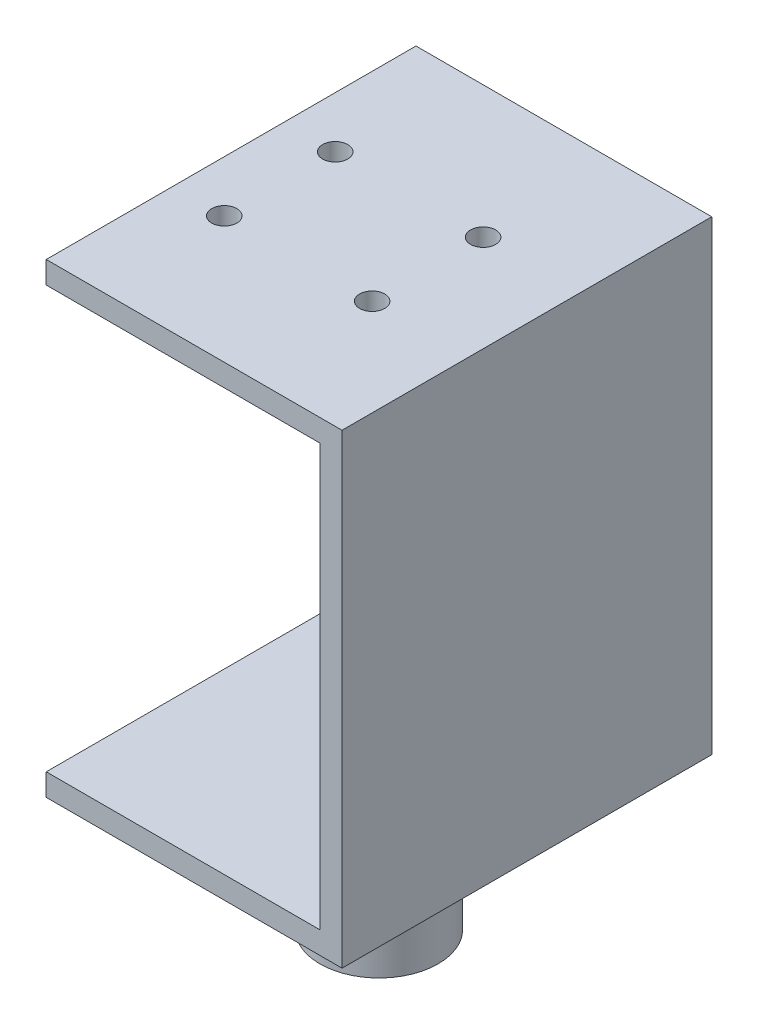
ISO-10303-21;
HEADER;
FILE_DESCRIPTION(('STEP AP214'),'2;1');
FILE_NAME('part.step','',(''),(''),'','','');
FILE_SCHEMA(('AUTOMOTIVE_DESIGN { 1 0 10303 214 1 1 1 1 }'));
ENDSEC;
DATA;
#1=APPLICATION_CONTEXT('core data for automotive mechanical design processes');
#2=APPLICATION_PROTOCOL_DEFINITION('international standard','automotive_design',2000,#1);
#3=PRODUCT_CONTEXT('',#1,'mechanical');
#4=PRODUCT('Part','Part','',(#3));
#5=PRODUCT_RELATED_PRODUCT_CATEGORY('part','',(#4));
#6=PRODUCT_DEFINITION_FORMATION('','',#4);
#7=PRODUCT_DEFINITION_CONTEXT('part definition',#1,'design');
#8=PRODUCT_DEFINITION('design','',#6,#7);
#9=PRODUCT_DEFINITION_SHAPE('','',#8);
#10=(LENGTH_UNIT() NAMED_UNIT(*) SI_UNIT(.MILLI.,.METRE.));
#11=(NAMED_UNIT(*) PLANE_ANGLE_UNIT() SI_UNIT($,.RADIAN.));
#12=(NAMED_UNIT(*) SI_UNIT($,.STERADIAN.) SOLID_ANGLE_UNIT());
#13=UNCERTAINTY_MEASURE_WITH_UNIT(LENGTH_MEASURE(1.E-05),#10,'distance_accuracy_value','');
#14=(GEOMETRIC_REPRESENTATION_CONTEXT(3) GLOBAL_UNCERTAINTY_ASSIGNED_CONTEXT((#13)) GLOBAL_UNIT_ASSIGNED_CONTEXT((#10,
#11,#12)) REPRESENTATION_CONTEXT('',''));
#15=CARTESIAN_POINT('',(0.,0.,0.));
#16=DIRECTION('',(0.,0.,1.));
#17=DIRECTION('',(1.,0.,0.));
#18=AXIS2_PLACEMENT_3D('',#15,#16,#17);
#19=CARTESIAN_POINT('',(-20.,17.0000000000001,25.));
#20=DIRECTION('',(0.,1.,0.));
#21=DIRECTION('',(0.,0.,1.));
#22=AXIS2_PLACEMENT_3D('',#19,#20,#21);
#23=PLANE('',#22);
#24=CARTESIAN_POINT('',(6.92740437151468,17.0000000000001,7.84999999999999));
#25=DIRECTION('',(0.,1.,0.));
#26=DIRECTION('',(0.,0.,1.));
#27=AXIS2_PLACEMENT_3D('',#24,#25,#26);
#28=CIRCLE('',#27,1.69999999999999);
#29=CARTESIAN_POINT('',(6.92740437151468,17.0000000000001,9.54999999999998));
#30=VERTEX_POINT('',#29);
#31=EDGE_CURVE('E282',#30,#30,#28,.F.);
#32=ORIENTED_EDGE('',*,*,#31,.F.);
#33=EDGE_LOOP('',(#32));
#34=FACE_BOUND('',#33,.T.);
#35=CARTESIAN_POINT('',(6.92740437151468,17.0000000000001,-7.15000000000001));
#36=DIRECTION('',(0.,1.,0.));
#37=DIRECTION('',(0.,0.,1.));
#38=AXIS2_PLACEMENT_3D('',#35,#36,#37);
#39=CIRCLE('',#38,1.69999999999999);
#40=CARTESIAN_POINT('',(6.92740437151468,17.0000000000001,-5.45000000000002));
#41=VERTEX_POINT('',#40);
#42=EDGE_CURVE('E290',#41,#41,#39,.F.);
#43=ORIENTED_EDGE('',*,*,#42,.F.);
#44=EDGE_LOOP('',(#43));
#45=FACE_BOUND('',#44,.T.);
#46=DIRECTION('',(1.,0.,0.));
#47=VECTOR('',#46,1.);
#48=CARTESIAN_POINT('',(-20.,17.0000000000001,-25.));
#49=LINE('',#48,#47);
#50=CARTESIAN_POINT('',(-20.,17.0000000000001,-25.));
#51=VERTEX_POINT('',#50);
#52=CARTESIAN_POINT('',(17.,17.0000000000001,-25.));
#53=VERTEX_POINT('',#52);
#54=EDGE_CURVE('E146',#51,#53,#49,.T.);
#55=ORIENTED_EDGE('',*,*,#54,.T.);
#56=DIRECTION('',(0.,0.,-1.));
#57=VECTOR('',#56,1.);
#58=CARTESIAN_POINT('',(17.,17.0000000000001,25.));
#59=LINE('',#58,#57);
#60=CARTESIAN_POINT('',(17.,17.0000000000001,25.));
#61=VERTEX_POINT('',#60);
#62=EDGE_CURVE('E183',#61,#53,#59,.T.);
#63=ORIENTED_EDGE('',*,*,#62,.F.);
#64=DIRECTION('',(1.,0.,0.));
#65=VECTOR('',#64,1.);
#66=CARTESIAN_POINT('',(-20.,17.0000000000001,25.));
#67=LINE('',#66,#65);
#68=CARTESIAN_POINT('',(-20.,17.0000000000001,25.));
#69=VERTEX_POINT('',#68);
#70=EDGE_CURVE('E98',#69,#61,#67,.T.);
#71=ORIENTED_EDGE('',*,*,#70,.F.);
#72=DIRECTION('',(0.,0.,-1.));
#73=VECTOR('',#72,1.);
#74=CARTESIAN_POINT('',(-20.,17.0000000000001,25.));
#75=LINE('',#74,#73);
#76=EDGE_CURVE('E43',#69,#51,#75,.T.);
#77=ORIENTED_EDGE('',*,*,#76,.T.);
#78=EDGE_LOOP('',(#55,#63,#71,#77));
#79=FACE_BOUND('',#78,.T.);
#80=CARTESIAN_POINT('',(-13.0725956284853,17.0000000000001,-7.15000000000002));
#81=DIRECTION('',(0.,1.,0.));
#82=DIRECTION('',(0.,0.,1.));
#83=AXIS2_PLACEMENT_3D('',#80,#81,#82);
#84=CIRCLE('',#83,1.69999999999999);
#85=CARTESIAN_POINT('',(-13.0725956284853,17.0000000000001,-5.45000000000003));
#86=VERTEX_POINT('',#85);
#87=EDGE_CURVE('E274',#86,#86,#84,.F.);
#88=ORIENTED_EDGE('',*,*,#87,.F.);
#89=EDGE_LOOP('',(#88));
#90=FACE_BOUND('',#89,.T.);
#91=CARTESIAN_POINT('',(-13.0725956284853,17.0000000000001,7.84999999999993));
#92=DIRECTION('',(0.,1.,0.));
#93=DIRECTION('',(0.,0.,1.));
#94=AXIS2_PLACEMENT_3D('',#91,#92,#93);
#95=CIRCLE('',#94,1.69999999999999);
#96=CARTESIAN_POINT('',(-13.0725956284853,17.0000000000001,9.54999999999992));
#97=VERTEX_POINT('',#96);
#98=EDGE_CURVE('E265',#97,#97,#95,.F.);
#99=ORIENTED_EDGE('',*,*,#98,.F.);
#100=EDGE_LOOP('',(#99));
#101=FACE_BOUND('',#100,.T.);
#102=ADVANCED_FACE('F39',(#34,#45,#79,#90,#101),#23,.F.);
#103=CARTESIAN_POINT('',(-20.,20.0000000000001,25.));
#104=DIRECTION('',(1.,0.,0.));
#105=DIRECTION('',(0.,0.,-1.));
#106=AXIS2_PLACEMENT_3D('',#103,#104,#105);
#107=PLANE('',#106);
#108=DIRECTION('',(0.,-1.,0.));
#109=VECTOR('',#108,1.);
#110=CARTESIAN_POINT('',(-20.,20.0000000000001,-25.));
#111=LINE('',#110,#109);
#112=CARTESIAN_POINT('',(-20.,20.0000000000001,-25.));
#113=VERTEX_POINT('',#112);
#114=EDGE_CURVE('E143',#113,#51,#111,.T.);
#115=ORIENTED_EDGE('',*,*,#114,.T.);
#116=ORIENTED_EDGE('',*,*,#76,.F.);
#117=DIRECTION('',(0.,-1.,0.));
#118=VECTOR('',#117,1.);
#119=CARTESIAN_POINT('',(-20.,20.0000000000001,25.));
#120=LINE('',#119,#118);
#121=CARTESIAN_POINT('',(-20.,20.0000000000001,25.));
#122=VERTEX_POINT('',#121);
#123=EDGE_CURVE('E169',#122,#69,#120,.T.);
#124=ORIENTED_EDGE('',*,*,#123,.F.);
#125=DIRECTION('',(0.,0.,-1.));
#126=VECTOR('',#125,1.);
#127=CARTESIAN_POINT('',(-20.,20.0000000000001,25.));
#128=LINE('',#127,#126);
#129=EDGE_CURVE('E58',#122,#113,#128,.T.);
#130=ORIENTED_EDGE('',*,*,#129,.T.);
#131=EDGE_LOOP('',(#115,#116,#124,#130));
#132=FACE_BOUND('',#131,.T.);
#133=ADVANCED_FACE('F41',(#132),#107,.F.);
#134=CARTESIAN_POINT('',(17.,17.0000000000001,25.));
#135=DIRECTION('',(1.,0.,0.));
#136=DIRECTION('',(0.,1.,0.));
#137=AXIS2_PLACEMENT_3D('',#134,#135,#136);
#138=PLANE('',#137);
#139=DIRECTION('',(0.,-1.,0.));
#140=VECTOR('',#139,1.);
#141=CARTESIAN_POINT('',(17.,17.0000000000001,-25.));
#142=LINE('',#141,#140);
#143=CARTESIAN_POINT('',(17.,-39.9999999999999,-25.));
#144=VERTEX_POINT('',#143);
#145=EDGE_CURVE('E150',#53,#144,#142,.T.);
#146=ORIENTED_EDGE('',*,*,#145,.T.);
#147=DIRECTION('',(0.,0.,-1.));
#148=VECTOR('',#147,1.);
#149=CARTESIAN_POINT('',(17.,-39.9999999999999,25.));
#150=LINE('',#149,#148);
#151=CARTESIAN_POINT('',(17.,-39.9999999999999,25.));
#152=VERTEX_POINT('',#151);
#153=EDGE_CURVE('E180',#152,#144,#150,.T.);
#154=ORIENTED_EDGE('',*,*,#153,.F.);
#155=DIRECTION('',(0.,-1.,0.));
#156=VECTOR('',#155,1.);
#157=CARTESIAN_POINT('',(17.,17.0000000000001,25.));
#158=LINE('',#157,#156);
#159=EDGE_CURVE('E304',#61,#152,#158,.T.);
#160=ORIENTED_EDGE('',*,*,#159,.F.);
#161=ORIENTED_EDGE('',*,*,#62,.T.);
#162=EDGE_LOOP('',(#146,#154,#160,#161));
#163=FACE_BOUND('',#162,.T.);
#164=ADVANCED_FACE('F212',(#163),#138,.F.);
#165=CARTESIAN_POINT('',(17.,-39.9999999999999,25.));
#166=DIRECTION('',(0.,-1.,0.));
#167=DIRECTION('',(0.,0.,-1.));
#168=AXIS2_PLACEMENT_3D('',#165,#166,#167);
#169=PLANE('',#168);
#170=DIRECTION('',(-1.,0.,0.));
#171=VECTOR('',#170,1.);
#172=CARTESIAN_POINT('',(17.,-39.9999999999999,-25.));
#173=LINE('',#172,#171);
#174=CARTESIAN_POINT('',(-20.,-39.9999999999999,-25.));
#175=VERTEX_POINT('',#174);
#176=EDGE_CURVE('E153',#144,#175,#173,.T.);
#177=ORIENTED_EDGE('',*,*,#176,.T.);
#178=DIRECTION('',(0.,0.,-1.));
#179=VECTOR('',#178,1.);
#180=CARTESIAN_POINT('',(-20.,-39.9999999999999,25.));
#181=LINE('',#180,#179);
#182=CARTESIAN_POINT('',(-20.,-39.9999999999999,25.));
#183=VERTEX_POINT('',#182);
#184=EDGE_CURVE('E176',#183,#175,#181,.T.);
#185=ORIENTED_EDGE('',*,*,#184,.F.);
#186=DIRECTION('',(-1.,0.,0.));
#187=VECTOR('',#186,1.);
#188=CARTESIAN_POINT('',(17.,-39.9999999999999,25.));
#189=LINE('',#188,#187);
#190=EDGE_CURVE('E307',#152,#183,#189,.T.);
#191=ORIENTED_EDGE('',*,*,#190,.F.);
#192=ORIENTED_EDGE('',*,*,#153,.T.);
#193=EDGE_LOOP('',(#177,#185,#191,#192));
#194=FACE_BOUND('',#193,.T.);
#195=ADVANCED_FACE('F218',(#194),#169,.F.);
#196=CARTESIAN_POINT('',(-20.,-39.9999999999999,25.));
#197=DIRECTION('',(1.,0.,0.));
#198=DIRECTION('',(0.,0.,-1.));
#199=AXIS2_PLACEMENT_3D('',#196,#197,#198);
#200=PLANE('',#199);
#201=DIRECTION('',(0.,-1.,0.));
#202=VECTOR('',#201,1.);
#203=CARTESIAN_POINT('',(-20.,-39.9999999999999,-25.));
#204=LINE('',#203,#202);
#205=CARTESIAN_POINT('',(-20.,-42.9999999999999,-25.));
#206=VERTEX_POINT('',#205);
#207=EDGE_CURVE('E156',#175,#206,#204,.T.);
#208=ORIENTED_EDGE('',*,*,#207,.T.);
#209=DIRECTION('',(0.,0.,-1.));
#210=VECTOR('',#209,1.);
#211=CARTESIAN_POINT('',(-20.,-42.9999999999999,25.));
#212=LINE('',#211,#210);
#213=CARTESIAN_POINT('',(-20.,-42.9999999999999,25.));
#214=VERTEX_POINT('',#213);
#215=EDGE_CURVE('E124',#214,#206,#212,.T.);
#216=ORIENTED_EDGE('',*,*,#215,.F.);
#217=DIRECTION('',(0.,-1.,0.));
#218=VECTOR('',#217,1.);
#219=CARTESIAN_POINT('',(-20.,-39.9999999999999,25.));
#220=LINE('',#219,#218);
#221=EDGE_CURVE('E131',#183,#214,#220,.T.);
#222=ORIENTED_EDGE('',*,*,#221,.F.);
#223=ORIENTED_EDGE('',*,*,#184,.T.);
#224=EDGE_LOOP('',(#208,#216,#222,#223));
#225=FACE_BOUND('',#224,.T.);
#226=ADVANCED_FACE('F221',(#225),#200,.F.);
#227=CARTESIAN_POINT('',(20.,-42.9999999999999,25.));
#228=DIRECTION('',(0.,-1.,0.));
#229=DIRECTION('',(1.,0.,0.));
#230=AXIS2_PLACEMENT_3D('',#227,#228,#229);
#231=PLANE('',#230);
#232=CARTESIAN_POINT('',(0.,-42.9999999999999,0.));
#233=DIRECTION('',(0.,-1.,0.));
#234=DIRECTION('',(1.,0.,0.));
#235=AXIS2_PLACEMENT_3D('',#232,#233,#234);
#236=CIRCLE('',#235,8.);
#237=CARTESIAN_POINT('',(8.00000000000001,-42.9999999999999,0.));
#238=VERTEX_POINT('',#237);
#239=EDGE_CURVE('E11',#238,#238,#236,.T.);
#240=ORIENTED_EDGE('',*,*,#239,.F.);
#241=EDGE_LOOP('',(#240));
#242=FACE_BOUND('',#241,.T.);
#243=DIRECTION('',(-1.,0.,0.));
#244=VECTOR('',#243,1.);
#245=CARTESIAN_POINT('',(20.,-42.9999999999999,-25.));
#246=LINE('',#245,#244);
#247=CARTESIAN_POINT('',(20.,-42.9999999999999,-25.));
#248=VERTEX_POINT('',#247);
#249=EDGE_CURVE('E120',#248,#206,#246,.T.);
#250=ORIENTED_EDGE('',*,*,#249,.F.);
#251=DIRECTION('',(0.,0.,-1.));
#252=VECTOR('',#251,1.);
#253=CARTESIAN_POINT('',(20.,-42.9999999999999,25.));
#254=LINE('',#253,#252);
#255=CARTESIAN_POINT('',(20.,-42.9999999999999,25.));
#256=VERTEX_POINT('',#255);
#257=EDGE_CURVE('E115',#256,#248,#254,.T.);
#258=ORIENTED_EDGE('',*,*,#257,.F.);
#259=DIRECTION('',(-1.,0.,0.));
#260=VECTOR('',#259,1.);
#261=CARTESIAN_POINT('',(20.,-42.9999999999999,25.));
#262=LINE('',#261,#260);
#263=EDGE_CURVE('E118',#256,#214,#262,.T.);
#264=ORIENTED_EDGE('',*,*,#263,.T.);
#265=ORIENTED_EDGE('',*,*,#215,.T.);
#266=EDGE_LOOP('',(#250,#258,#264,#265));
#267=FACE_BOUND('',#266,.T.);
#268=ADVANCED_FACE('F117',(#242,#267),#231,.T.);
#269=CARTESIAN_POINT('',(20.,20.0000000000001,25.));
#270=DIRECTION('',(1.,0.,0.));
#271=DIRECTION('',(0.,1.,0.));
#272=AXIS2_PLACEMENT_3D('',#269,#270,#271);
#273=PLANE('',#272);
#274=DIRECTION('',(0.,-1.,0.));
#275=VECTOR('',#274,1.);
#276=CARTESIAN_POINT('',(20.,20.0000000000001,-25.));
#277=LINE('',#276,#275);
#278=CARTESIAN_POINT('',(20.,20.0000000000001,-25.));
#279=VERTEX_POINT('',#278);
#280=EDGE_CURVE('E162',#279,#248,#277,.T.);
#281=ORIENTED_EDGE('',*,*,#280,.F.);
#282=DIRECTION('',(0.,0.,-1.));
#283=VECTOR('',#282,1.);
#284=CARTESIAN_POINT('',(20.,20.0000000000001,25.));
#285=LINE('',#284,#283);
#286=CARTESIAN_POINT('',(20.,20.0000000000001,25.));
#287=VERTEX_POINT('',#286);
#288=EDGE_CURVE('E85',#287,#279,#285,.T.);
#289=ORIENTED_EDGE('',*,*,#288,.F.);
#290=DIRECTION('',(0.,-1.,0.));
#291=VECTOR('',#290,1.);
#292=CARTESIAN_POINT('',(20.,-39.9999999999999,25.));
#293=LINE('',#292,#291);
#294=EDGE_CURVE('E129',#287,#256,#293,.T.);
#295=ORIENTED_EDGE('',*,*,#294,.T.);
#296=ORIENTED_EDGE('',*,*,#257,.T.);
#297=EDGE_LOOP('',(#281,#289,#295,#296));
#298=FACE_BOUND('',#297,.T.);
#299=ADVANCED_FACE('F135',(#298),#273,.T.);
#300=CARTESIAN_POINT('',(-20.,20.0000000000001,25.));
#301=DIRECTION('',(0.,1.,0.));
#302=DIRECTION('',(0.,0.,1.));
#303=AXIS2_PLACEMENT_3D('',#300,#301,#302);
#304=PLANE('',#303);
#305=CARTESIAN_POINT('',(-13.0725956284853,20.0000000000001,7.84999999999993));
#306=DIRECTION('',(0.,1.,0.));
#307=DIRECTION('',(0.,0.,1.));
#308=AXIS2_PLACEMENT_3D('',#305,#306,#307);
#309=CIRCLE('',#308,1.69999999999999);
#310=CARTESIAN_POINT('',(-13.0725956284853,20.0000000000001,9.54999999999992));
#311=VERTEX_POINT('',#310);
#312=EDGE_CURVE('E267',#311,#311,#309,.T.);
#313=ORIENTED_EDGE('',*,*,#312,.F.);
#314=EDGE_LOOP('',(#313));
#315=FACE_BOUND('',#314,.T.);
#316=CARTESIAN_POINT('',(-13.0725956284853,20.0000000000001,-7.15000000000002));
#317=DIRECTION('',(0.,1.,0.));
#318=DIRECTION('',(0.,0.,1.));
#319=AXIS2_PLACEMENT_3D('',#316,#317,#318);
#320=CIRCLE('',#319,1.69999999999999);
#321=CARTESIAN_POINT('',(-13.0725956284853,20.0000000000001,-5.45000000000003));
#322=VERTEX_POINT('',#321);
#323=EDGE_CURVE('E271',#322,#322,#320,.T.);
#324=ORIENTED_EDGE('',*,*,#323,.F.);
#325=EDGE_LOOP('',(#324));
#326=FACE_BOUND('',#325,.T.);
#327=CARTESIAN_POINT('',(6.92740437151468,20.0000000000001,7.84999999999999));
#328=DIRECTION('',(0.,1.,0.));
#329=DIRECTION('',(0.,0.,1.));
#330=AXIS2_PLACEMENT_3D('',#327,#328,#329);
#331=CIRCLE('',#330,1.69999999999999);
#332=CARTESIAN_POINT('',(6.92740437151468,20.0000000000001,9.54999999999998));
#333=VERTEX_POINT('',#332);
#334=EDGE_CURVE('E278',#333,#333,#331,.T.);
#335=ORIENTED_EDGE('',*,*,#334,.F.);
#336=EDGE_LOOP('',(#335));
#337=FACE_BOUND('',#336,.T.);
#338=CARTESIAN_POINT('',(6.92740437151468,20.0000000000001,-7.15000000000001));
#339=DIRECTION('',(0.,1.,0.));
#340=DIRECTION('',(0.,0.,1.));
#341=AXIS2_PLACEMENT_3D('',#338,#339,#340);
#342=CIRCLE('',#341,1.69999999999999);
#343=CARTESIAN_POINT('',(6.92740437151468,20.0000000000001,-5.45000000000002));
#344=VERTEX_POINT('',#343);
#345=EDGE_CURVE('E286',#344,#344,#342,.T.);
#346=ORIENTED_EDGE('',*,*,#345,.F.);
#347=EDGE_LOOP('',(#346));
#348=FACE_BOUND('',#347,.T.);
#349=DIRECTION('',(1.,0.,0.));
#350=VECTOR('',#349,1.);
#351=CARTESIAN_POINT('',(-20.,20.0000000000001,-25.));
#352=LINE('',#351,#350);
#353=EDGE_CURVE('E165',#113,#279,#352,.T.);
#354=ORIENTED_EDGE('',*,*,#353,.F.);
#355=ORIENTED_EDGE('',*,*,#129,.F.);
#356=DIRECTION('',(1.,0.,0.));
#357=VECTOR('',#356,1.);
#358=CARTESIAN_POINT('',(-20.,20.0000000000001,25.));
#359=LINE('',#358,#357);
#360=EDGE_CURVE('E137',#122,#287,#359,.T.);
#361=ORIENTED_EDGE('',*,*,#360,.T.);
#362=ORIENTED_EDGE('',*,*,#288,.T.);
#363=EDGE_LOOP('',(#354,#355,#361,#362));
#364=FACE_BOUND('',#363,.T.);
#365=ADVANCED_FACE('F194',(#315,#326,#337,#348,#364),#304,.T.);
#366=CARTESIAN_POINT('',(0.,0.,25.));
#367=DIRECTION('',(0.,0.,1.));
#368=DIRECTION('',(1.,0.,0.));
#369=AXIS2_PLACEMENT_3D('',#366,#367,#368);
#370=PLANE('',#369);
#371=ORIENTED_EDGE('',*,*,#123,.T.);
#372=ORIENTED_EDGE('',*,*,#70,.T.);
#373=ORIENTED_EDGE('',*,*,#159,.T.);
#374=ORIENTED_EDGE('',*,*,#190,.T.);
#375=ORIENTED_EDGE('',*,*,#221,.T.);
#376=ORIENTED_EDGE('',*,*,#263,.F.);
#377=ORIENTED_EDGE('',*,*,#294,.F.);
#378=ORIENTED_EDGE('',*,*,#360,.F.);
#379=EDGE_LOOP('',(#371,#372,#373,#374,#375,#376,#377,#378));
#380=FACE_BOUND('',#379,.T.);
#381=ADVANCED_FACE('F127',(#380),#370,.T.);
#382=CARTESIAN_POINT('',(0.,0.,-25.));
#383=DIRECTION('',(0.,0.,1.));
#384=DIRECTION('',(1.,0.,0.));
#385=AXIS2_PLACEMENT_3D('',#382,#383,#384);
#386=PLANE('',#385);
#387=ORIENTED_EDGE('',*,*,#114,.F.);
#388=ORIENTED_EDGE('',*,*,#353,.T.);
#389=ORIENTED_EDGE('',*,*,#280,.T.);
#390=ORIENTED_EDGE('',*,*,#249,.T.);
#391=ORIENTED_EDGE('',*,*,#207,.F.);
#392=ORIENTED_EDGE('',*,*,#176,.F.);
#393=ORIENTED_EDGE('',*,*,#145,.F.);
#394=ORIENTED_EDGE('',*,*,#54,.F.);
#395=EDGE_LOOP('',(#387,#388,#389,#390,#391,#392,#393,#394));
#396=FACE_BOUND('',#395,.T.);
#397=ADVANCED_FACE('F193',(#396),#386,.F.);
#398=CARTESIAN_POINT('',(0.,-60.9999999999999,0.));
#399=DIRECTION('',(0.,1.,0.));
#400=DIRECTION('',(-1.,0.,0.));
#401=AXIS2_PLACEMENT_3D('',#398,#399,#400);
#402=CYLINDRICAL_SURFACE('',#401,8.);
#403=CARTESIAN_POINT('',(0.,-60.9999999999999,0.));
#404=DIRECTION('',(0.,-1.,0.));
#405=DIRECTION('',(1.,0.,0.));
#406=AXIS2_PLACEMENT_3D('',#403,#404,#405);
#407=CIRCLE('',#406,8.);
#408=CARTESIAN_POINT('',(8.00000000000001,-60.9999999999999,0.));
#409=VERTEX_POINT('',#408);
#410=EDGE_CURVE('E147',#409,#409,#407,.T.);
#411=ORIENTED_EDGE('',*,*,#410,.F.);
#412=EDGE_LOOP('',(#411));
#413=FACE_BOUND('',#412,.T.);
#414=ORIENTED_EDGE('',*,*,#239,.T.);
#415=EDGE_LOOP('',(#414));
#416=FACE_BOUND('',#415,.T.);
#417=ADVANCED_FACE('F232',(#413,#416),#402,.T.);
#418=CARTESIAN_POINT('',(0.,-60.9999999999999,0.));
#419=DIRECTION('',(0.,-1.,0.));
#420=DIRECTION('',(1.,0.,0.));
#421=AXIS2_PLACEMENT_3D('',#418,#419,#420);
#422=PLANE('',#421);
#423=ORIENTED_EDGE('',*,*,#410,.T.);
#424=EDGE_LOOP('',(#423));
#425=FACE_BOUND('',#424,.T.);
#426=ADVANCED_FACE('F234',(#425),#422,.T.);
#427=CARTESIAN_POINT('',(6.92740437151468,20.0000000000001,-7.15000000000001));
#428=DIRECTION('',(0.,1.,0.));
#429=DIRECTION('',(0.,0.,1.));
#430=AXIS2_PLACEMENT_3D('',#427,#428,#429);
#431=CYLINDRICAL_SURFACE('',#430,1.69999999999999);
#432=ORIENTED_EDGE('',*,*,#42,.T.);
#433=EDGE_LOOP('',(#432));
#434=FACE_BOUND('',#433,.T.);
#435=ORIENTED_EDGE('',*,*,#345,.T.);
#436=EDGE_LOOP('',(#435));
#437=FACE_BOUND('',#436,.T.);
#438=ADVANCED_FACE('F241',(#434,#437),#431,.F.);
#439=CARTESIAN_POINT('',(6.92740437151468,20.0000000000001,7.84999999999999));
#440=DIRECTION('',(0.,1.,0.));
#441=DIRECTION('',(0.,0.,1.));
#442=AXIS2_PLACEMENT_3D('',#439,#440,#441);
#443=CYLINDRICAL_SURFACE('',#442,1.69999999999999);
#444=ORIENTED_EDGE('',*,*,#31,.T.);
#445=EDGE_LOOP('',(#444));
#446=FACE_BOUND('',#445,.T.);
#447=ORIENTED_EDGE('',*,*,#334,.T.);
#448=EDGE_LOOP('',(#447));
#449=FACE_BOUND('',#448,.T.);
#450=ADVANCED_FACE('F248',(#446,#449),#443,.F.);
#451=CARTESIAN_POINT('',(-13.0725956284853,20.0000000000001,-7.15000000000002));
#452=DIRECTION('',(0.,1.,0.));
#453=DIRECTION('',(0.,0.,1.));
#454=AXIS2_PLACEMENT_3D('',#451,#452,#453);
#455=CYLINDRICAL_SURFACE('',#454,1.69999999999999);
#456=ORIENTED_EDGE('',*,*,#87,.T.);
#457=EDGE_LOOP('',(#456));
#458=FACE_BOUND('',#457,.T.);
#459=ORIENTED_EDGE('',*,*,#323,.T.);
#460=EDGE_LOOP('',(#459));
#461=FACE_BOUND('',#460,.T.);
#462=ADVANCED_FACE('F252',(#458,#461),#455,.F.);
#463=CARTESIAN_POINT('',(-13.0725956284853,20.0000000000001,7.84999999999993));
#464=DIRECTION('',(0.,1.,0.));
#465=DIRECTION('',(0.,0.,1.));
#466=AXIS2_PLACEMENT_3D('',#463,#464,#465);
#467=CYLINDRICAL_SURFACE('',#466,1.69999999999999);
#468=ORIENTED_EDGE('',*,*,#98,.T.);
#469=EDGE_LOOP('',(#468));
#470=FACE_BOUND('',#469,.T.);
#471=ORIENTED_EDGE('',*,*,#312,.T.);
#472=EDGE_LOOP('',(#471));
#473=FACE_BOUND('',#472,.T.);
#474=ADVANCED_FACE('F256',(#470,#473),#467,.F.);
#475=CLOSED_SHELL('',(#102,#133,#164,#195,#226,#268,#299,#365,#381,#397,#417,#426,#438,#450,
#462,#474));
#476=MANIFOLD_SOLID_BREP('B2',#475);
#477=ADVANCED_BREP_SHAPE_REPRESENTATION('',(#18,#476),#14);
#478=SHAPE_DEFINITION_REPRESENTATION(#9,#477);
ENDSEC;
END-ISO-10303-21;
